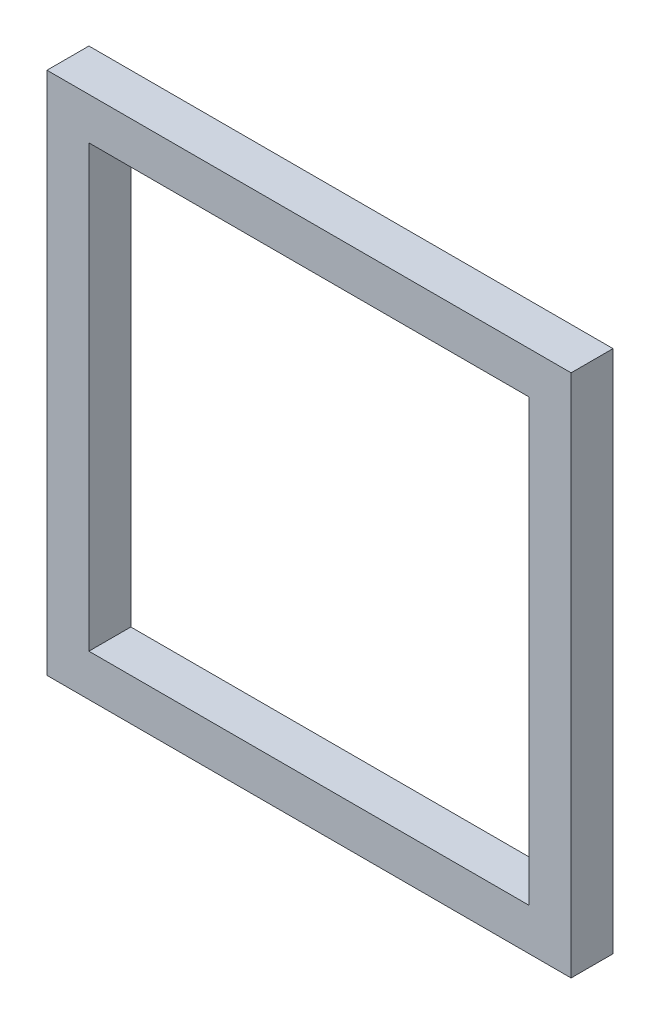
ISO-10303-21;
HEADER;
FILE_DESCRIPTION(('STEP AP214'),'2;1');
FILE_NAME('part.step','',(''),(''),'','','');
FILE_SCHEMA(('AUTOMOTIVE_DESIGN { 1 0 10303 214 1 1 1 1 }'));
ENDSEC;
DATA;
#1=APPLICATION_CONTEXT('core data for automotive mechanical design processes');
#2=APPLICATION_PROTOCOL_DEFINITION('international standard','automotive_design',2000,#1);
#3=PRODUCT_CONTEXT('',#1,'mechanical');
#4=PRODUCT('Part','Part','',(#3));
#5=PRODUCT_RELATED_PRODUCT_CATEGORY('part','',(#4));
#6=PRODUCT_DEFINITION_FORMATION('','',#4);
#7=PRODUCT_DEFINITION_CONTEXT('part definition',#1,'design');
#8=PRODUCT_DEFINITION('design','',#6,#7);
#9=PRODUCT_DEFINITION_SHAPE('','',#8);
#10=(LENGTH_UNIT() NAMED_UNIT(*) SI_UNIT(.MILLI.,.METRE.));
#11=(NAMED_UNIT(*) PLANE_ANGLE_UNIT() SI_UNIT($,.RADIAN.));
#12=(NAMED_UNIT(*) SI_UNIT($,.STERADIAN.) SOLID_ANGLE_UNIT());
#13=UNCERTAINTY_MEASURE_WITH_UNIT(LENGTH_MEASURE(1.E-05),#10,'distance_accuracy_value','');
#14=(GEOMETRIC_REPRESENTATION_CONTEXT(3) GLOBAL_UNCERTAINTY_ASSIGNED_CONTEXT((#13)) GLOBAL_UNIT_ASSIGNED_CONTEXT((#10,
#11,#12)) REPRESENTATION_CONTEXT('',''));
#15=CARTESIAN_POINT('',(0.,0.,0.));
#16=DIRECTION('',(0.,0.,1.));
#17=DIRECTION('',(1.,0.,0.));
#18=AXIS2_PLACEMENT_3D('',#15,#16,#17);
#19=CARTESIAN_POINT('',(0.,0.,4.));
#20=DIRECTION('',(0.,0.,1.));
#21=DIRECTION('',(1.,0.,0.));
#22=AXIS2_PLACEMENT_3D('',#19,#20,#21);
#23=PLANE('',#22);
#24=DIRECTION('',(0.,-1.,0.));
#25=VECTOR('',#24,1.);
#26=CARTESIAN_POINT('',(-23.7058823529412,14.4852941176471,4.));
#27=LINE('',#26,#25);
#28=CARTESIAN_POINT('',(-23.7058823529412,14.4852941176471,4.));
#29=VERTEX_POINT('',#28);
#30=CARTESIAN_POINT('',(-23.7058823529412,-35.5147058823529,4.));
#31=VERTEX_POINT('',#30);
#32=EDGE_CURVE('E153',#29,#31,#27,.T.);
#33=ORIENTED_EDGE('',*,*,#32,.T.);
#34=DIRECTION('',(1.,0.,0.));
#35=VECTOR('',#34,1.);
#36=CARTESIAN_POINT('',(-23.7058823529412,-35.5147058823529,4.));
#37=LINE('',#36,#35);
#38=CARTESIAN_POINT('',(26.2941176470588,-35.5147058823529,4.));
#39=VERTEX_POINT('',#38);
#40=EDGE_CURVE('E157',#31,#39,#37,.T.);
#41=ORIENTED_EDGE('',*,*,#40,.T.);
#42=DIRECTION('',(0.,1.,0.));
#43=VECTOR('',#42,1.);
#44=CARTESIAN_POINT('',(26.2941176470588,14.4852941176471,4.));
#45=LINE('',#44,#43);
#46=CARTESIAN_POINT('',(26.2941176470588,14.4852941176471,4.));
#47=VERTEX_POINT('',#46);
#48=EDGE_CURVE('E161',#39,#47,#45,.T.);
#49=ORIENTED_EDGE('',*,*,#48,.T.);
#50=DIRECTION('',(-1.,0.,0.));
#51=VECTOR('',#50,1.);
#52=CARTESIAN_POINT('',(-23.7058823529412,14.4852941176471,4.));
#53=LINE('',#52,#51);
#54=EDGE_CURVE('E164',#47,#29,#53,.T.);
#55=ORIENTED_EDGE('',*,*,#54,.T.);
#56=EDGE_LOOP('',(#33,#41,#49,#55));
#57=FACE_BOUND('',#56,.T.);
#58=DIRECTION('',(1.,0.,0.));
#59=VECTOR('',#58,1.);
#60=CARTESIAN_POINT('',(-19.7058823529412,-31.5147058823529,4.));
#61=LINE('',#60,#59);
#62=CARTESIAN_POINT('',(-19.7058823529412,-31.5147058823529,4.));
#63=VERTEX_POINT('',#62);
#64=CARTESIAN_POINT('',(22.2941176470588,-31.5147058823529,4.));
#65=VERTEX_POINT('',#64);
#66=EDGE_CURVE('E114',#63,#65,#61,.T.);
#67=ORIENTED_EDGE('',*,*,#66,.F.);
#68=DIRECTION('',(0.,-1.,0.));
#69=VECTOR('',#68,1.);
#70=CARTESIAN_POINT('',(-19.7058823529412,10.4852941176471,4.));
#71=LINE('',#70,#69);
#72=CARTESIAN_POINT('',(-19.7058823529412,10.4852941176471,4.));
#73=VERTEX_POINT('',#72);
#74=EDGE_CURVE('E105',#73,#63,#71,.T.);
#75=ORIENTED_EDGE('',*,*,#74,.F.);
#76=DIRECTION('',(-1.,0.,0.));
#77=VECTOR('',#76,1.);
#78=CARTESIAN_POINT('',(-19.7058823529412,10.4852941176471,4.));
#79=LINE('',#78,#77);
#80=CARTESIAN_POINT('',(22.2941176470588,10.4852941176471,4.));
#81=VERTEX_POINT('',#80);
#82=EDGE_CURVE('E131',#81,#73,#79,.T.);
#83=ORIENTED_EDGE('',*,*,#82,.F.);
#84=DIRECTION('',(0.,1.,0.));
#85=VECTOR('',#84,1.);
#86=CARTESIAN_POINT('',(22.2941176470588,10.4852941176471,4.));
#87=LINE('',#86,#85);
#88=EDGE_CURVE('E127',#65,#81,#87,.T.);
#89=ORIENTED_EDGE('',*,*,#88,.F.);
#90=EDGE_LOOP('',(#67,#75,#83,#89));
#91=FACE_BOUND('',#90,.T.);
#92=ADVANCED_FACE('F39',(#57,#91),#23,.T.);
#93=CARTESIAN_POINT('',(0.,0.,0.));
#94=DIRECTION('',(0.,0.,1.));
#95=DIRECTION('',(1.,0.,0.));
#96=AXIS2_PLACEMENT_3D('',#93,#94,#95);
#97=PLANE('',#96);
#98=DIRECTION('',(0.,-1.,0.));
#99=VECTOR('',#98,1.);
#100=CARTESIAN_POINT('',(-23.7058823529412,14.4852941176471,0.));
#101=LINE('',#100,#99);
#102=CARTESIAN_POINT('',(-23.7058823529412,14.4852941176471,0.));
#103=VERTEX_POINT('',#102);
#104=CARTESIAN_POINT('',(-23.7058823529412,-35.5147058823529,0.));
#105=VERTEX_POINT('',#104);
#106=EDGE_CURVE('E123',#103,#105,#101,.T.);
#107=ORIENTED_EDGE('',*,*,#106,.F.);
#108=DIRECTION('',(-1.,0.,0.));
#109=VECTOR('',#108,1.);
#110=CARTESIAN_POINT('',(-23.7058823529412,14.4852941176471,0.));
#111=LINE('',#110,#109);
#112=CARTESIAN_POINT('',(26.2941176470588,14.4852941176471,0.));
#113=VERTEX_POINT('',#112);
#114=EDGE_CURVE('E158',#113,#103,#111,.T.);
#115=ORIENTED_EDGE('',*,*,#114,.F.);
#116=DIRECTION('',(0.,1.,0.));
#117=VECTOR('',#116,1.);
#118=CARTESIAN_POINT('',(26.2941176470588,14.4852941176471,0.));
#119=LINE('',#118,#117);
#120=CARTESIAN_POINT('',(26.2941176470588,-35.5147058823529,0.));
#121=VERTEX_POINT('',#120);
#122=EDGE_CURVE('E174',#121,#113,#119,.T.);
#123=ORIENTED_EDGE('',*,*,#122,.F.);
#124=DIRECTION('',(1.,0.,0.));
#125=VECTOR('',#124,1.);
#126=CARTESIAN_POINT('',(-23.7058823529412,-35.5147058823529,0.));
#127=LINE('',#126,#125);
#128=EDGE_CURVE('E171',#105,#121,#127,.T.);
#129=ORIENTED_EDGE('',*,*,#128,.F.);
#130=EDGE_LOOP('',(#107,#115,#123,#129));
#131=FACE_BOUND('',#130,.T.);
#132=DIRECTION('',(0.,-1.,0.));
#133=VECTOR('',#132,1.);
#134=CARTESIAN_POINT('',(-19.7058823529412,10.4852941176471,0.));
#135=LINE('',#134,#133);
#136=CARTESIAN_POINT('',(-19.7058823529412,10.4852941176471,0.));
#137=VERTEX_POINT('',#136);
#138=CARTESIAN_POINT('',(-19.7058823529412,-31.5147058823529,0.));
#139=VERTEX_POINT('',#138);
#140=EDGE_CURVE('E63',#137,#139,#135,.T.);
#141=ORIENTED_EDGE('',*,*,#140,.T.);
#142=DIRECTION('',(1.,0.,0.));
#143=VECTOR('',#142,1.);
#144=CARTESIAN_POINT('',(-19.7058823529412,-31.5147058823529,0.));
#145=LINE('',#144,#143);
#146=CARTESIAN_POINT('',(22.2941176470588,-31.5147058823529,0.));
#147=VERTEX_POINT('',#146);
#148=EDGE_CURVE('E121',#139,#147,#145,.T.);
#149=ORIENTED_EDGE('',*,*,#148,.T.);
#150=DIRECTION('',(0.,1.,0.));
#151=VECTOR('',#150,1.);
#152=CARTESIAN_POINT('',(22.2941176470588,10.4852941176471,0.));
#153=LINE('',#152,#151);
#154=CARTESIAN_POINT('',(22.2941176470588,10.4852941176471,0.));
#155=VERTEX_POINT('',#154);
#156=EDGE_CURVE('E140',#147,#155,#153,.T.);
#157=ORIENTED_EDGE('',*,*,#156,.T.);
#158=DIRECTION('',(-1.,0.,0.));
#159=VECTOR('',#158,1.);
#160=CARTESIAN_POINT('',(-19.7058823529412,10.4852941176471,0.));
#161=LINE('',#160,#159);
#162=EDGE_CURVE('E115',#155,#137,#161,.T.);
#163=ORIENTED_EDGE('',*,*,#162,.T.);
#164=EDGE_LOOP('',(#141,#149,#157,#163));
#165=FACE_BOUND('',#164,.T.);
#166=ADVANCED_FACE('F197',(#131,#165),#97,.F.);
#167=CARTESIAN_POINT('',(-23.7058823529412,14.4852941176471,4.));
#168=DIRECTION('',(1.,0.,0.));
#169=DIRECTION('',(0.,1.,0.));
#170=AXIS2_PLACEMENT_3D('',#167,#168,#169);
#171=PLANE('',#170);
#172=ORIENTED_EDGE('',*,*,#106,.T.);
#173=DIRECTION('',(0.,0.,-1.));
#174=VECTOR('',#173,1.);
#175=CARTESIAN_POINT('',(-23.7058823529412,-35.5147058823529,4.));
#176=LINE('',#175,#174);
#177=EDGE_CURVE('E11',#31,#105,#176,.T.);
#178=ORIENTED_EDGE('',*,*,#177,.F.);
#179=ORIENTED_EDGE('',*,*,#32,.F.);
#180=DIRECTION('',(0.,0.,-1.));
#181=VECTOR('',#180,1.);
#182=CARTESIAN_POINT('',(-23.7058823529412,14.4852941176471,4.));
#183=LINE('',#182,#181);
#184=EDGE_CURVE('E167',#29,#103,#183,.T.);
#185=ORIENTED_EDGE('',*,*,#184,.T.);
#186=EDGE_LOOP('',(#172,#178,#179,#185));
#187=FACE_BOUND('',#186,.T.);
#188=ADVANCED_FACE('F41',(#187),#171,.F.);
#189=CARTESIAN_POINT('',(-23.7058823529412,-35.5147058823529,4.));
#190=DIRECTION('',(0.,1.,0.));
#191=DIRECTION('',(0.,0.,1.));
#192=AXIS2_PLACEMENT_3D('',#189,#190,#191);
#193=PLANE('',#192);
#194=ORIENTED_EDGE('',*,*,#128,.T.);
#195=DIRECTION('',(0.,0.,-1.));
#196=VECTOR('',#195,1.);
#197=CARTESIAN_POINT('',(26.2941176470588,-35.5147058823529,4.));
#198=LINE('',#197,#196);
#199=EDGE_CURVE('E48',#39,#121,#198,.T.);
#200=ORIENTED_EDGE('',*,*,#199,.F.);
#201=ORIENTED_EDGE('',*,*,#40,.F.);
#202=ORIENTED_EDGE('',*,*,#177,.T.);
#203=EDGE_LOOP('',(#194,#200,#201,#202));
#204=FACE_BOUND('',#203,.T.);
#205=ADVANCED_FACE('F207',(#204),#193,.F.);
#206=CARTESIAN_POINT('',(26.2941176470588,14.4852941176471,4.));
#207=DIRECTION('',(-1.,0.,0.));
#208=DIRECTION('',(0.,-1.,0.));
#209=AXIS2_PLACEMENT_3D('',#206,#207,#208);
#210=PLANE('',#209);
#211=ORIENTED_EDGE('',*,*,#122,.T.);
#212=DIRECTION('',(0.,0.,-1.));
#213=VECTOR('',#212,1.);
#214=CARTESIAN_POINT('',(26.2941176470588,14.4852941176471,4.));
#215=LINE('',#214,#213);
#216=EDGE_CURVE('E182',#47,#113,#215,.T.);
#217=ORIENTED_EDGE('',*,*,#216,.F.);
#218=ORIENTED_EDGE('',*,*,#48,.F.);
#219=ORIENTED_EDGE('',*,*,#199,.T.);
#220=EDGE_LOOP('',(#211,#217,#218,#219));
#221=FACE_BOUND('',#220,.T.);
#222=ADVANCED_FACE('F191',(#221),#210,.F.);
#223=CARTESIAN_POINT('',(-23.7058823529412,14.4852941176471,4.));
#224=DIRECTION('',(0.,-1.,0.));
#225=DIRECTION('',(0.,0.,-1.));
#226=AXIS2_PLACEMENT_3D('',#223,#224,#225);
#227=PLANE('',#226);
#228=ORIENTED_EDGE('',*,*,#114,.T.);
#229=ORIENTED_EDGE('',*,*,#184,.F.);
#230=ORIENTED_EDGE('',*,*,#54,.F.);
#231=ORIENTED_EDGE('',*,*,#216,.T.);
#232=EDGE_LOOP('',(#228,#229,#230,#231));
#233=FACE_BOUND('',#232,.T.);
#234=ADVANCED_FACE('F201',(#233),#227,.F.);
#235=CARTESIAN_POINT('',(-19.7058823529412,10.4852941176471,4.));
#236=DIRECTION('',(1.,0.,0.));
#237=DIRECTION('',(0.,1.,0.));
#238=AXIS2_PLACEMENT_3D('',#235,#236,#237);
#239=PLANE('',#238);
#240=ORIENTED_EDGE('',*,*,#140,.F.);
#241=DIRECTION('',(0.,0.,-1.));
#242=VECTOR('',#241,1.);
#243=CARTESIAN_POINT('',(-19.7058823529412,10.4852941176471,4.));
#244=LINE('',#243,#242);
#245=EDGE_CURVE('E109',#73,#137,#244,.T.);
#246=ORIENTED_EDGE('',*,*,#245,.F.);
#247=ORIENTED_EDGE('',*,*,#74,.T.);
#248=DIRECTION('',(0.,0.,-1.));
#249=VECTOR('',#248,1.);
#250=CARTESIAN_POINT('',(-19.7058823529412,-31.5147058823529,4.));
#251=LINE('',#250,#249);
#252=EDGE_CURVE('E108',#63,#139,#251,.T.);
#253=ORIENTED_EDGE('',*,*,#252,.T.);
#254=EDGE_LOOP('',(#240,#246,#247,#253));
#255=FACE_BOUND('',#254,.T.);
#256=ADVANCED_FACE('F107',(#255),#239,.T.);
#257=CARTESIAN_POINT('',(-19.7058823529412,-31.5147058823529,4.));
#258=DIRECTION('',(0.,1.,0.));
#259=DIRECTION('',(0.,0.,1.));
#260=AXIS2_PLACEMENT_3D('',#257,#258,#259);
#261=PLANE('',#260);
#262=ORIENTED_EDGE('',*,*,#148,.F.);
#263=ORIENTED_EDGE('',*,*,#252,.F.);
#264=ORIENTED_EDGE('',*,*,#66,.T.);
#265=DIRECTION('',(0.,0.,-1.));
#266=VECTOR('',#265,1.);
#267=CARTESIAN_POINT('',(22.2941176470588,-31.5147058823529,4.));
#268=LINE('',#267,#266);
#269=EDGE_CURVE('E124',#65,#147,#268,.T.);
#270=ORIENTED_EDGE('',*,*,#269,.T.);
#271=EDGE_LOOP('',(#262,#263,#264,#270));
#272=FACE_BOUND('',#271,.T.);
#273=ADVANCED_FACE('F118',(#272),#261,.T.);
#274=CARTESIAN_POINT('',(22.2941176470588,10.4852941176471,4.));
#275=DIRECTION('',(-1.,0.,0.));
#276=DIRECTION('',(0.,-1.,0.));
#277=AXIS2_PLACEMENT_3D('',#274,#275,#276);
#278=PLANE('',#277);
#279=ORIENTED_EDGE('',*,*,#156,.F.);
#280=ORIENTED_EDGE('',*,*,#269,.F.);
#281=ORIENTED_EDGE('',*,*,#88,.T.);
#282=DIRECTION('',(0.,0.,-1.));
#283=VECTOR('',#282,1.);
#284=CARTESIAN_POINT('',(22.2941176470588,10.4852941176471,4.));
#285=LINE('',#284,#283);
#286=EDGE_CURVE('E55',#81,#155,#285,.T.);
#287=ORIENTED_EDGE('',*,*,#286,.T.);
#288=EDGE_LOOP('',(#279,#280,#281,#287));
#289=FACE_BOUND('',#288,.T.);
#290=ADVANCED_FACE('F230',(#289),#278,.T.);
#291=CARTESIAN_POINT('',(-19.7058823529412,10.4852941176471,4.));
#292=DIRECTION('',(0.,-1.,0.));
#293=DIRECTION('',(1.,0.,0.));
#294=AXIS2_PLACEMENT_3D('',#291,#292,#293);
#295=PLANE('',#294);
#296=ORIENTED_EDGE('',*,*,#162,.F.);
#297=ORIENTED_EDGE('',*,*,#286,.F.);
#298=ORIENTED_EDGE('',*,*,#82,.T.);
#299=ORIENTED_EDGE('',*,*,#245,.T.);
#300=EDGE_LOOP('',(#296,#297,#298,#299));
#301=FACE_BOUND('',#300,.T.);
#302=ADVANCED_FACE('F234',(#301),#295,.T.);
#303=CLOSED_SHELL('',(#92,#166,#188,#205,#222,#234,#256,#273,#290,#302));
#304=MANIFOLD_SOLID_BREP('B2',#303);
#305=ADVANCED_BREP_SHAPE_REPRESENTATION('',(#18,#304),#14);
#306=SHAPE_DEFINITION_REPRESENTATION(#9,#305);
ENDSEC;
END-ISO-10303-21;
